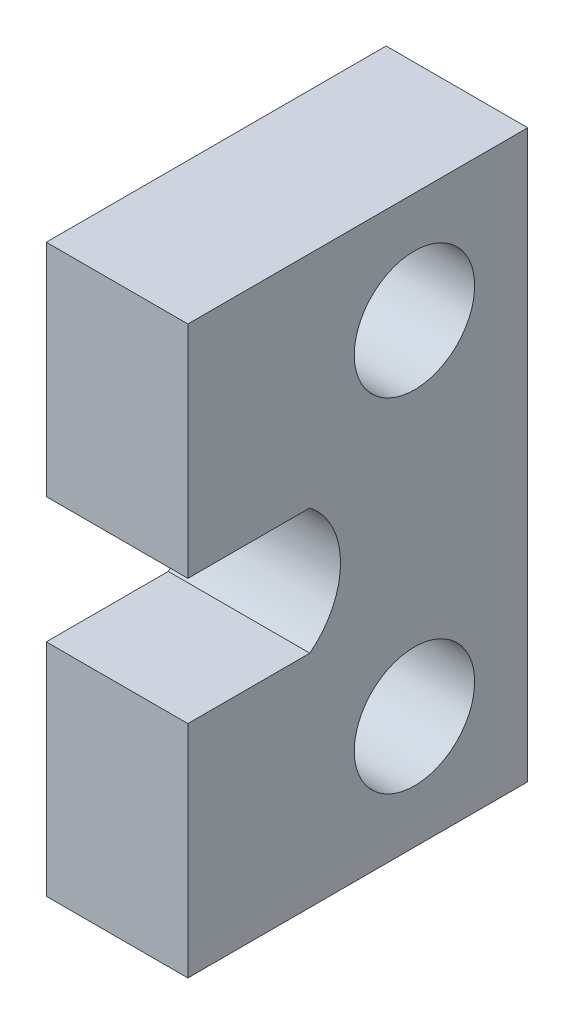
ISO-10303-21;
HEADER;
FILE_DESCRIPTION(('STEP AP214'),'2;1');
FILE_NAME('part.step','',(''),(''),'','','');
FILE_SCHEMA(('AUTOMOTIVE_DESIGN { 1 0 10303 214 1 1 1 1 }'));
ENDSEC;
DATA;
#1=APPLICATION_CONTEXT('core data for automotive mechanical design processes');
#2=APPLICATION_PROTOCOL_DEFINITION('international standard','automotive_design',2000,#1);
#3=PRODUCT_CONTEXT('',#1,'mechanical');
#4=PRODUCT('Part','Part','',(#3));
#5=PRODUCT_RELATED_PRODUCT_CATEGORY('part','',(#4));
#6=PRODUCT_DEFINITION_FORMATION('','',#4);
#7=PRODUCT_DEFINITION_CONTEXT('part definition',#1,'design');
#8=PRODUCT_DEFINITION('design','',#6,#7);
#9=PRODUCT_DEFINITION_SHAPE('','',#8);
#10=(LENGTH_UNIT() NAMED_UNIT(*) SI_UNIT(.MILLI.,.METRE.));
#11=(NAMED_UNIT(*) PLANE_ANGLE_UNIT() SI_UNIT($,.RADIAN.));
#12=(NAMED_UNIT(*) SI_UNIT($,.STERADIAN.) SOLID_ANGLE_UNIT());
#13=UNCERTAINTY_MEASURE_WITH_UNIT(LENGTH_MEASURE(1.E-05),#10,'distance_accuracy_value','');
#14=(GEOMETRIC_REPRESENTATION_CONTEXT(3) GLOBAL_UNCERTAINTY_ASSIGNED_CONTEXT((#13)) GLOBAL_UNIT_ASSIGNED_CONTEXT((#10,
#11,#12)) REPRESENTATION_CONTEXT('',''));
#15=CARTESIAN_POINT('',(0.,0.,0.));
#16=DIRECTION('',(0.,0.,1.));
#17=DIRECTION('',(1.,0.,0.));
#18=AXIS2_PLACEMENT_3D('',#15,#16,#17);
#19=CARTESIAN_POINT('',(0.,0.,38.1));
#20=DIRECTION('',(0.,0.,-1.));
#21=DIRECTION('',(-1.,0.,0.));
#22=AXIS2_PLACEMENT_3D('',#19,#20,#21);
#23=PLANE('',#22);
#24=DIRECTION('',(0.,1.,0.));
#25=VECTOR('',#24,1.);
#26=CARTESIAN_POINT('',(15.875,0.,38.1));
#27=LINE('',#26,#25);
#28=CARTESIAN_POINT('',(15.875,0.,38.1));
#29=VERTEX_POINT('',#28);
#30=CARTESIAN_POINT('',(15.875,24.7015,38.1));
#31=VERTEX_POINT('',#30);
#32=EDGE_CURVE('E328',#29,#31,#27,.T.);
#33=ORIENTED_EDGE('',*,*,#32,.T.);
#34=DIRECTION('',(-1.,0.,0.));
#35=VECTOR('',#34,1.);
#36=CARTESIAN_POINT('',(15.875,24.7015,38.1));
#37=LINE('',#36,#35);
#38=CARTESIAN_POINT('',(0.,24.7015,38.1));
#39=VERTEX_POINT('',#38);
#40=EDGE_CURVE('E230',#31,#39,#37,.T.);
#41=ORIENTED_EDGE('',*,*,#40,.T.);
#42=DIRECTION('',(0.,-1.,0.));
#43=VECTOR('',#42,1.);
#44=CARTESIAN_POINT('',(0.,0.,38.1));
#45=LINE('',#44,#43);
#46=CARTESIAN_POINT('',(0.,0.,38.1));
#47=VERTEX_POINT('',#46);
#48=EDGE_CURVE('E192',#39,#47,#45,.T.);
#49=ORIENTED_EDGE('',*,*,#48,.T.);
#50=DIRECTION('',(1.,0.,0.));
#51=VECTOR('',#50,1.);
#52=CARTESIAN_POINT('',(0.,0.,38.1));
#53=LINE('',#52,#51);
#54=EDGE_CURVE('E322',#47,#29,#53,.T.);
#55=ORIENTED_EDGE('',*,*,#54,.T.);
#56=EDGE_LOOP('',(#33,#41,#49,#55));
#57=FACE_BOUND('',#56,.T.);
#58=ADVANCED_FACE('F138',(#57),#23,.F.);
#59=CARTESIAN_POINT('',(0.,63.5,38.1));
#60=VERTEX_POINT('',#59);
#61=CARTESIAN_POINT('',(0.,38.7985,38.1));
#62=VERTEX_POINT('',#61);
#63=EDGE_CURVE('E317',#60,#62,#45,.T.);
#64=ORIENTED_EDGE('',*,*,#63,.T.);
#65=DIRECTION('',(-1.,0.,0.));
#66=VECTOR('',#65,1.);
#67=CARTESIAN_POINT('',(15.875,38.7985,38.1));
#68=LINE('',#67,#66);
#69=CARTESIAN_POINT('',(15.875,38.7985,38.1));
#70=VERTEX_POINT('',#69);
#71=EDGE_CURVE('E292',#70,#62,#68,.T.);
#72=ORIENTED_EDGE('',*,*,#71,.F.);
#73=CARTESIAN_POINT('',(15.875,63.5,38.1));
#74=VERTEX_POINT('',#73);
#75=EDGE_CURVE('E327',#70,#74,#27,.T.);
#76=ORIENTED_EDGE('',*,*,#75,.T.);
#77=DIRECTION('',(-1.,0.,0.));
#78=VECTOR('',#77,1.);
#79=CARTESIAN_POINT('',(0.,63.5,38.1));
#80=LINE('',#79,#78);
#81=EDGE_CURVE('E164',#74,#60,#80,.T.);
#82=ORIENTED_EDGE('',*,*,#81,.T.);
#83=EDGE_LOOP('',(#64,#72,#76,#82));
#84=FACE_BOUND('',#83,.T.);
#85=ADVANCED_FACE('F365',(#84),#23,.F.);
#86=CARTESIAN_POINT('',(0.,0.,38.1));
#87=DIRECTION('',(1.,0.,0.));
#88=DIRECTION('',(0.,0.,-1.));
#89=AXIS2_PLACEMENT_3D('',#86,#87,#88);
#90=PLANE('',#89);
#91=CARTESIAN_POINT('',(0.,12.7,12.7));
#92=DIRECTION('',(-1.,0.,0.));
#93=DIRECTION('',(0.,0.,1.));
#94=AXIS2_PLACEMENT_3D('',#91,#92,#93);
#95=CIRCLE('',#94,6.746875);
#96=CARTESIAN_POINT('',(0.,12.7,19.446875));
#97=VERTEX_POINT('',#96);
#98=EDGE_CURVE('E281',#97,#97,#95,.T.);
#99=ORIENTED_EDGE('',*,*,#98,.F.);
#100=EDGE_LOOP('',(#99));
#101=FACE_BOUND('',#100,.T.);
#102=CARTESIAN_POINT('',(0.,51.14925,12.7));
#103=DIRECTION('',(-1.,0.,0.));
#104=DIRECTION('',(0.,0.,1.));
#105=AXIS2_PLACEMENT_3D('',#102,#103,#104);
#106=CIRCLE('',#105,6.746875);
#107=CARTESIAN_POINT('',(0.,51.14925,19.446875));
#108=VERTEX_POINT('',#107);
#109=EDGE_CURVE('E277',#108,#108,#106,.T.);
#110=ORIENTED_EDGE('',*,*,#109,.F.);
#111=EDGE_LOOP('',(#110));
#112=FACE_BOUND('',#111,.T.);
#113=CARTESIAN_POINT('',(0.,31.75,29.9191654505863));
#114=DIRECTION('',(-1.,0.,0.));
#115=DIRECTION('',(0.,0.,1.));
#116=AXIS2_PLACEMENT_3D('',#113,#114,#115);
#117=CIRCLE('',#116,8.935);
#118=CARTESIAN_POINT('',(0.,38.7985,24.4280022996682));
#119=VERTEX_POINT('',#118);
#120=CARTESIAN_POINT('',(0.,24.7015,24.4280022996682));
#121=VERTEX_POINT('',#120);
#122=EDGE_CURVE('E222',#119,#121,#117,.T.);
#123=ORIENTED_EDGE('',*,*,#122,.F.);
#124=DIRECTION('',(0.,0.,-1.));
#125=VECTOR('',#124,1.);
#126=CARTESIAN_POINT('',(0.,38.7985,0.));
#127=LINE('',#126,#125);
#128=EDGE_CURVE('E239',#62,#119,#127,.T.);
#129=ORIENTED_EDGE('',*,*,#128,.F.);
#130=ORIENTED_EDGE('',*,*,#63,.F.);
#131=DIRECTION('',(0.,0.,-1.));
#132=VECTOR('',#131,1.);
#133=CARTESIAN_POINT('',(0.,63.5,38.1));
#134=LINE('',#133,#132);
#135=CARTESIAN_POINT('',(0.,63.5,0.));
#136=VERTEX_POINT('',#135);
#137=EDGE_CURVE('E380',#60,#136,#134,.T.);
#138=ORIENTED_EDGE('',*,*,#137,.T.);
#139=DIRECTION('',(0.,-1.,0.));
#140=VECTOR('',#139,1.);
#141=CARTESIAN_POINT('',(0.,0.,0.));
#142=LINE('',#141,#140);
#143=CARTESIAN_POINT('',(0.,0.,0.));
#144=VERTEX_POINT('',#143);
#145=EDGE_CURVE('E264',#136,#144,#142,.T.);
#146=ORIENTED_EDGE('',*,*,#145,.T.);
#147=DIRECTION('',(0.,0.,-1.));
#148=VECTOR('',#147,1.);
#149=CARTESIAN_POINT('',(0.,0.,38.1));
#150=LINE('',#149,#148);
#151=EDGE_CURVE('E13',#47,#144,#150,.T.);
#152=ORIENTED_EDGE('',*,*,#151,.F.);
#153=ORIENTED_EDGE('',*,*,#48,.F.);
#154=DIRECTION('',(0.,0.,1.));
#155=VECTOR('',#154,1.);
#156=CARTESIAN_POINT('',(0.,24.7015,0.));
#157=LINE('',#156,#155);
#158=EDGE_CURVE('E155',#121,#39,#157,.T.);
#159=ORIENTED_EDGE('',*,*,#158,.F.);
#160=EDGE_LOOP('',(#123,#129,#130,#138,#146,#152,#153,#159));
#161=FACE_BOUND('',#160,.T.);
#162=ADVANCED_FACE('F140',(#101,#112,#161),#90,.F.);
#163=CARTESIAN_POINT('',(0.,0.,38.1));
#164=DIRECTION('',(0.,1.,0.));
#165=DIRECTION('',(0.,0.,1.));
#166=AXIS2_PLACEMENT_3D('',#163,#164,#165);
#167=PLANE('',#166);
#168=DIRECTION('',(1.,0.,0.));
#169=VECTOR('',#168,1.);
#170=CARTESIAN_POINT('',(0.,0.,0.));
#171=LINE('',#170,#169);
#172=CARTESIAN_POINT('',(15.875,0.,0.));
#173=VERTEX_POINT('',#172);
#174=EDGE_CURVE('E307',#144,#173,#171,.T.);
#175=ORIENTED_EDGE('',*,*,#174,.T.);
#176=DIRECTION('',(0.,0.,-1.));
#177=VECTOR('',#176,1.);
#178=CARTESIAN_POINT('',(15.875,0.,38.1));
#179=LINE('',#178,#177);
#180=EDGE_CURVE('E148',#29,#173,#179,.T.);
#181=ORIENTED_EDGE('',*,*,#180,.F.);
#182=ORIENTED_EDGE('',*,*,#54,.F.);
#183=ORIENTED_EDGE('',*,*,#151,.T.);
#184=EDGE_LOOP('',(#175,#181,#182,#183));
#185=FACE_BOUND('',#184,.T.);
#186=ADVANCED_FACE('F364',(#185),#167,.F.);
#187=CARTESIAN_POINT('',(15.875,0.,38.1));
#188=DIRECTION('',(-1.,0.,0.));
#189=DIRECTION('',(0.,0.,1.));
#190=AXIS2_PLACEMENT_3D('',#187,#188,#189);
#191=PLANE('',#190);
#192=CARTESIAN_POINT('',(15.875,12.7,12.7));
#193=DIRECTION('',(-1.,0.,0.));
#194=DIRECTION('',(0.,0.,1.));
#195=AXIS2_PLACEMENT_3D('',#192,#193,#194);
#196=CIRCLE('',#195,6.746875);
#197=CARTESIAN_POINT('',(15.875,12.7,19.446875));
#198=VERTEX_POINT('',#197);
#199=EDGE_CURVE('E342',#198,#198,#196,.T.);
#200=ORIENTED_EDGE('',*,*,#199,.T.);
#201=EDGE_LOOP('',(#200));
#202=FACE_BOUND('',#201,.T.);
#203=CARTESIAN_POINT('',(15.875,51.14925,12.7));
#204=DIRECTION('',(-1.,0.,0.));
#205=DIRECTION('',(0.,0.,1.));
#206=AXIS2_PLACEMENT_3D('',#203,#204,#205);
#207=CIRCLE('',#206,6.746875);
#208=CARTESIAN_POINT('',(15.875,51.14925,19.446875));
#209=VERTEX_POINT('',#208);
#210=EDGE_CURVE('E248',#209,#209,#207,.T.);
#211=ORIENTED_EDGE('',*,*,#210,.T.);
#212=EDGE_LOOP('',(#211));
#213=FACE_BOUND('',#212,.T.);
#214=ORIENTED_EDGE('',*,*,#75,.F.);
#215=DIRECTION('',(0.,0.,-1.));
#216=VECTOR('',#215,1.);
#217=CARTESIAN_POINT('',(15.875,38.7985,0.));
#218=LINE('',#217,#216);
#219=CARTESIAN_POINT('',(15.875,38.7985,24.4280022996682));
#220=VERTEX_POINT('',#219);
#221=EDGE_CURVE('E225',#70,#220,#218,.T.);
#222=ORIENTED_EDGE('',*,*,#221,.T.);
#223=CARTESIAN_POINT('',(15.875,31.75,29.9191654505863));
#224=DIRECTION('',(-1.,0.,0.));
#225=DIRECTION('',(0.,0.,1.));
#226=AXIS2_PLACEMENT_3D('',#223,#224,#225);
#227=CIRCLE('',#226,8.935);
#228=CARTESIAN_POINT('',(15.875,24.7015,24.4280022996682));
#229=VERTEX_POINT('',#228);
#230=EDGE_CURVE('E219',#220,#229,#227,.T.);
#231=ORIENTED_EDGE('',*,*,#230,.T.);
#232=DIRECTION('',(0.,0.,1.));
#233=VECTOR('',#232,1.);
#234=CARTESIAN_POINT('',(15.875,24.7015,0.));
#235=LINE('',#234,#233);
#236=EDGE_CURVE('E228',#229,#31,#235,.T.);
#237=ORIENTED_EDGE('',*,*,#236,.T.);
#238=ORIENTED_EDGE('',*,*,#32,.F.);
#239=ORIENTED_EDGE('',*,*,#180,.T.);
#240=DIRECTION('',(0.,1.,0.));
#241=VECTOR('',#240,1.);
#242=CARTESIAN_POINT('',(15.875,0.,0.));
#243=LINE('',#242,#241);
#244=CARTESIAN_POINT('',(15.875,63.5,0.));
#245=VERTEX_POINT('',#244);
#246=EDGE_CURVE('E374',#173,#245,#243,.T.);
#247=ORIENTED_EDGE('',*,*,#246,.T.);
#248=DIRECTION('',(0.,0.,-1.));
#249=VECTOR('',#248,1.);
#250=CARTESIAN_POINT('',(15.875,63.5,38.1));
#251=LINE('',#250,#249);
#252=EDGE_CURVE('E384',#74,#245,#251,.T.);
#253=ORIENTED_EDGE('',*,*,#252,.F.);
#254=EDGE_LOOP('',(#214,#222,#231,#237,#238,#239,#247,#253));
#255=FACE_BOUND('',#254,.T.);
#256=ADVANCED_FACE('F237',(#202,#213,#255),#191,.F.);
#257=CARTESIAN_POINT('',(0.,63.5,38.1));
#258=DIRECTION('',(0.,-1.,0.));
#259=DIRECTION('',(0.,0.,-1.));
#260=AXIS2_PLACEMENT_3D('',#257,#258,#259);
#261=PLANE('',#260);
#262=DIRECTION('',(-1.,0.,0.));
#263=VECTOR('',#262,1.);
#264=CARTESIAN_POINT('',(0.,63.5,0.));
#265=LINE('',#264,#263);
#266=EDGE_CURVE('E185',#245,#136,#265,.T.);
#267=ORIENTED_EDGE('',*,*,#266,.T.);
#268=ORIENTED_EDGE('',*,*,#137,.F.);
#269=ORIENTED_EDGE('',*,*,#81,.F.);
#270=ORIENTED_EDGE('',*,*,#252,.T.);
#271=EDGE_LOOP('',(#267,#268,#269,#270));
#272=FACE_BOUND('',#271,.T.);
#273=ADVANCED_FACE('F402',(#272),#261,.F.);
#274=CARTESIAN_POINT('',(0.,0.,0.));
#275=DIRECTION('',(0.,0.,-1.));
#276=DIRECTION('',(-1.,0.,0.));
#277=AXIS2_PLACEMENT_3D('',#274,#275,#276);
#278=PLANE('',#277);
#279=ORIENTED_EDGE('',*,*,#145,.F.);
#280=ORIENTED_EDGE('',*,*,#266,.F.);
#281=ORIENTED_EDGE('',*,*,#246,.F.);
#282=ORIENTED_EDGE('',*,*,#174,.F.);
#283=EDGE_LOOP('',(#279,#280,#281,#282));
#284=FACE_BOUND('',#283,.T.);
#285=ADVANCED_FACE('F401',(#284),#278,.T.);
#286=CARTESIAN_POINT('',(15.875,38.7985,0.));
#287=DIRECTION('',(0.,1.,0.));
#288=DIRECTION('',(0.,0.,1.));
#289=AXIS2_PLACEMENT_3D('',#286,#287,#288);
#290=PLANE('',#289);
#291=ORIENTED_EDGE('',*,*,#128,.T.);
#292=DIRECTION('',(-1.,0.,0.));
#293=VECTOR('',#292,1.);
#294=CARTESIAN_POINT('',(15.875,38.7985,24.4280022996682));
#295=LINE('',#294,#293);
#296=EDGE_CURVE('E224',#220,#119,#295,.T.);
#297=ORIENTED_EDGE('',*,*,#296,.F.);
#298=ORIENTED_EDGE('',*,*,#221,.F.);
#299=ORIENTED_EDGE('',*,*,#71,.T.);
#300=EDGE_LOOP('',(#291,#297,#298,#299));
#301=FACE_BOUND('',#300,.T.);
#302=ADVANCED_FACE('F422',(#301),#290,.F.);
#303=CARTESIAN_POINT('',(15.875,24.7015,0.));
#304=DIRECTION('',(0.,-1.,0.));
#305=DIRECTION('',(0.,0.,-1.));
#306=AXIS2_PLACEMENT_3D('',#303,#304,#305);
#307=PLANE('',#306);
#308=ORIENTED_EDGE('',*,*,#158,.T.);
#309=ORIENTED_EDGE('',*,*,#40,.F.);
#310=ORIENTED_EDGE('',*,*,#236,.F.);
#311=DIRECTION('',(-1.,0.,0.));
#312=VECTOR('',#311,1.);
#313=CARTESIAN_POINT('',(15.875,24.7015,24.4280022996682));
#314=LINE('',#313,#312);
#315=EDGE_CURVE('E215',#229,#121,#314,.T.);
#316=ORIENTED_EDGE('',*,*,#315,.T.);
#317=EDGE_LOOP('',(#308,#309,#310,#316));
#318=FACE_BOUND('',#317,.T.);
#319=ADVANCED_FACE('F229',(#318),#307,.F.);
#320=CARTESIAN_POINT('',(15.875,31.75,29.9191654505863));
#321=DIRECTION('',(-1.,0.,0.));
#322=DIRECTION('',(0.,0.,1.));
#323=AXIS2_PLACEMENT_3D('',#320,#321,#322);
#324=CYLINDRICAL_SURFACE('',#323,8.935);
#325=ORIENTED_EDGE('',*,*,#122,.T.);
#326=ORIENTED_EDGE('',*,*,#315,.F.);
#327=ORIENTED_EDGE('',*,*,#230,.F.);
#328=ORIENTED_EDGE('',*,*,#296,.T.);
#329=EDGE_LOOP('',(#325,#326,#327,#328));
#330=FACE_BOUND('',#329,.T.);
#331=ADVANCED_FACE('F217',(#330),#324,.F.);
#332=CARTESIAN_POINT('',(15.875,51.14925,12.7));
#333=DIRECTION('',(-1.,0.,0.));
#334=DIRECTION('',(0.,0.,1.));
#335=AXIS2_PLACEMENT_3D('',#332,#333,#334);
#336=CYLINDRICAL_SURFACE('',#335,6.746875);
#337=ORIENTED_EDGE('',*,*,#109,.T.);
#338=EDGE_LOOP('',(#337));
#339=FACE_BOUND('',#338,.T.);
#340=ORIENTED_EDGE('',*,*,#210,.F.);
#341=EDGE_LOOP('',(#340));
#342=FACE_BOUND('',#341,.T.);
#343=ADVANCED_FACE('F464',(#339,#342),#336,.F.);
#344=CARTESIAN_POINT('',(15.875,12.7,12.7));
#345=DIRECTION('',(-1.,0.,0.));
#346=DIRECTION('',(0.,0.,1.));
#347=AXIS2_PLACEMENT_3D('',#344,#345,#346);
#348=CYLINDRICAL_SURFACE('',#347,6.746875);
#349=ORIENTED_EDGE('',*,*,#199,.F.);
#350=EDGE_LOOP('',(#349));
#351=FACE_BOUND('',#350,.T.);
#352=ORIENTED_EDGE('',*,*,#98,.T.);
#353=EDGE_LOOP('',(#352));
#354=FACE_BOUND('',#353,.T.);
#355=ADVANCED_FACE('F360',(#351,#354),#348,.F.);
#356=CLOSED_SHELL('',(#58,#85,#162,#186,#256,#273,#285,#302,#319,#331,#343,#355));
#357=MANIFOLD_SOLID_BREP('B2',#356);
#358=ADVANCED_BREP_SHAPE_REPRESENTATION('',(#18,#357),#14);
#359=SHAPE_DEFINITION_REPRESENTATION(#9,#358);
ENDSEC;
END-ISO-10303-21;
